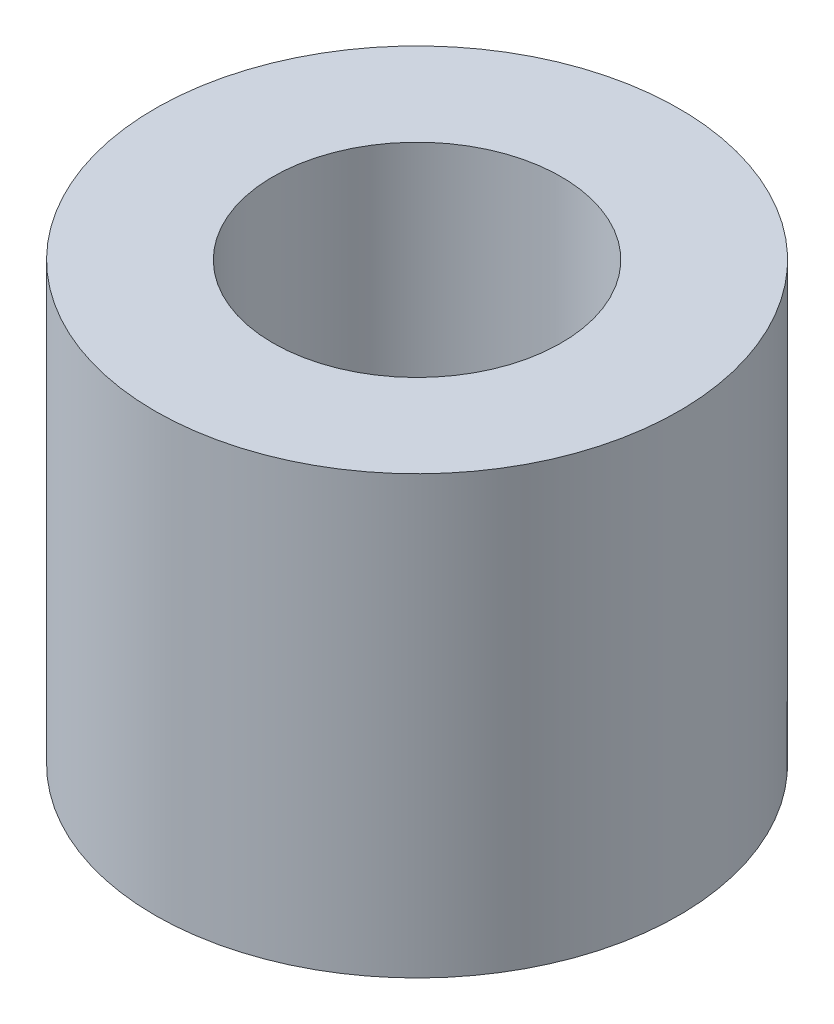
ISO-10303-21;
HEADER;
FILE_DESCRIPTION(('STEP AP214'),'2;1');
FILE_NAME('part.step','',(''),(''),'','','');
FILE_SCHEMA(('AUTOMOTIVE_DESIGN { 1 0 10303 214 1 1 1 1 }'));
ENDSEC;
DATA;
#1=APPLICATION_CONTEXT('core data for automotive mechanical design processes');
#2=APPLICATION_PROTOCOL_DEFINITION('international standard','automotive_design',2000,#1);
#3=PRODUCT_CONTEXT('',#1,'mechanical');
#4=PRODUCT('Part','Part','',(#3));
#5=PRODUCT_RELATED_PRODUCT_CATEGORY('part','',(#4));
#6=PRODUCT_DEFINITION_FORMATION('','',#4);
#7=PRODUCT_DEFINITION_CONTEXT('part definition',#1,'design');
#8=PRODUCT_DEFINITION('design','',#6,#7);
#9=PRODUCT_DEFINITION_SHAPE('','',#8);
#10=(LENGTH_UNIT() NAMED_UNIT(*) SI_UNIT(.MILLI.,.METRE.));
#11=(NAMED_UNIT(*) PLANE_ANGLE_UNIT() SI_UNIT($,.RADIAN.));
#12=(NAMED_UNIT(*) SI_UNIT($,.STERADIAN.) SOLID_ANGLE_UNIT());
#13=UNCERTAINTY_MEASURE_WITH_UNIT(LENGTH_MEASURE(1.E-05),#10,'distance_accuracy_value','');
#14=(GEOMETRIC_REPRESENTATION_CONTEXT(3) GLOBAL_UNCERTAINTY_ASSIGNED_CONTEXT((#13)) GLOBAL_UNIT_ASSIGNED_CONTEXT((#10,
#11,#12)) REPRESENTATION_CONTEXT('',''));
#15=CARTESIAN_POINT('',(0.,0.,0.));
#16=DIRECTION('',(0.,0.,1.));
#17=DIRECTION('',(1.,0.,0.));
#18=AXIS2_PLACEMENT_3D('',#15,#16,#17);
#19=CARTESIAN_POINT('',(0.,5.,0.));
#20=DIRECTION('',(0.,1.,0.));
#21=DIRECTION('',(0.,0.,1.));
#22=AXIS2_PLACEMENT_3D('',#19,#20,#21);
#23=PLANE('',#22);
#24=CARTESIAN_POINT('',(0.,5.,0.));
#25=DIRECTION('',(0.,1.,0.));
#26=DIRECTION('',(0.,0.,1.));
#27=AXIS2_PLACEMENT_3D('',#24,#25,#26);
#28=CIRCLE('',#27,3.);
#29=CARTESIAN_POINT('',(0.,5.,3.));
#30=VERTEX_POINT('',#29);
#31=EDGE_CURVE('E10',#30,#30,#28,.T.);
#32=ORIENTED_EDGE('',*,*,#31,.T.);
#33=EDGE_LOOP('',(#32));
#34=FACE_BOUND('',#33,.T.);
#35=CARTESIAN_POINT('',(0.,5.,0.));
#36=DIRECTION('',(0.,1.,0.));
#37=DIRECTION('',(0.,0.,1.));
#38=AXIS2_PLACEMENT_3D('',#35,#36,#37);
#39=CIRCLE('',#38,1.65);
#40=CARTESIAN_POINT('',(0.,5.,1.65));
#41=VERTEX_POINT('',#40);
#42=EDGE_CURVE('E50',#41,#41,#39,.T.);
#43=ORIENTED_EDGE('',*,*,#42,.F.);
#44=EDGE_LOOP('',(#43));
#45=FACE_BOUND('',#44,.T.);
#46=ADVANCED_FACE('F37',(#34,#45),#23,.T.);
#47=CARTESIAN_POINT('',(0.,0.,0.));
#48=DIRECTION('',(0.,1.,0.));
#49=DIRECTION('',(0.,0.,1.));
#50=AXIS2_PLACEMENT_3D('',#47,#48,#49);
#51=PLANE('',#50);
#52=CARTESIAN_POINT('',(0.,0.,0.));
#53=DIRECTION('',(0.,1.,0.));
#54=DIRECTION('',(0.,0.,1.));
#55=AXIS2_PLACEMENT_3D('',#52,#53,#54);
#56=CIRCLE('',#55,3.);
#57=CARTESIAN_POINT('',(0.,0.,3.));
#58=VERTEX_POINT('',#57);
#59=EDGE_CURVE('E41',#58,#58,#56,.T.);
#60=ORIENTED_EDGE('',*,*,#59,.F.);
#61=EDGE_LOOP('',(#60));
#62=FACE_BOUND('',#61,.T.);
#63=CARTESIAN_POINT('',(0.,0.,0.));
#64=DIRECTION('',(0.,1.,0.));
#65=DIRECTION('',(0.,0.,1.));
#66=AXIS2_PLACEMENT_3D('',#63,#64,#65);
#67=CIRCLE('',#66,1.65);
#68=CARTESIAN_POINT('',(0.,0.,1.65));
#69=VERTEX_POINT('',#68);
#70=EDGE_CURVE('E52',#69,#69,#67,.T.);
#71=ORIENTED_EDGE('',*,*,#70,.T.);
#72=EDGE_LOOP('',(#71));
#73=FACE_BOUND('',#72,.T.);
#74=ADVANCED_FACE('F64',(#62,#73),#51,.F.);
#75=CARTESIAN_POINT('',(0.,5.,0.));
#76=DIRECTION('',(0.,-1.,0.));
#77=DIRECTION('',(0.,0.,-1.));
#78=AXIS2_PLACEMENT_3D('',#75,#76,#77);
#79=CYLINDRICAL_SURFACE('',#78,3.);
#80=ORIENTED_EDGE('',*,*,#31,.F.);
#81=EDGE_LOOP('',(#80));
#82=FACE_BOUND('',#81,.T.);
#83=ORIENTED_EDGE('',*,*,#59,.T.);
#84=EDGE_LOOP('',(#83));
#85=FACE_BOUND('',#84,.T.);
#86=ADVANCED_FACE('F39',(#82,#85),#79,.T.);
#87=CARTESIAN_POINT('',(0.,5.,0.));
#88=DIRECTION('',(0.,-1.,0.));
#89=DIRECTION('',(0.,0.,-1.));
#90=AXIS2_PLACEMENT_3D('',#87,#88,#89);
#91=CYLINDRICAL_SURFACE('',#90,1.65);
#92=ORIENTED_EDGE('',*,*,#42,.T.);
#93=EDGE_LOOP('',(#92));
#94=FACE_BOUND('',#93,.T.);
#95=ORIENTED_EDGE('',*,*,#70,.F.);
#96=EDGE_LOOP('',(#95));
#97=FACE_BOUND('',#96,.T.);
#98=ADVANCED_FACE('F60',(#94,#97),#91,.F.);
#99=CLOSED_SHELL('',(#46,#74,#86,#98));
#100=MANIFOLD_SOLID_BREP('B2',#99);
#101=ADVANCED_BREP_SHAPE_REPRESENTATION('',(#18,#100),#14);
#102=SHAPE_DEFINITION_REPRESENTATION(#9,#101);
ENDSEC;
END-ISO-10303-21;
